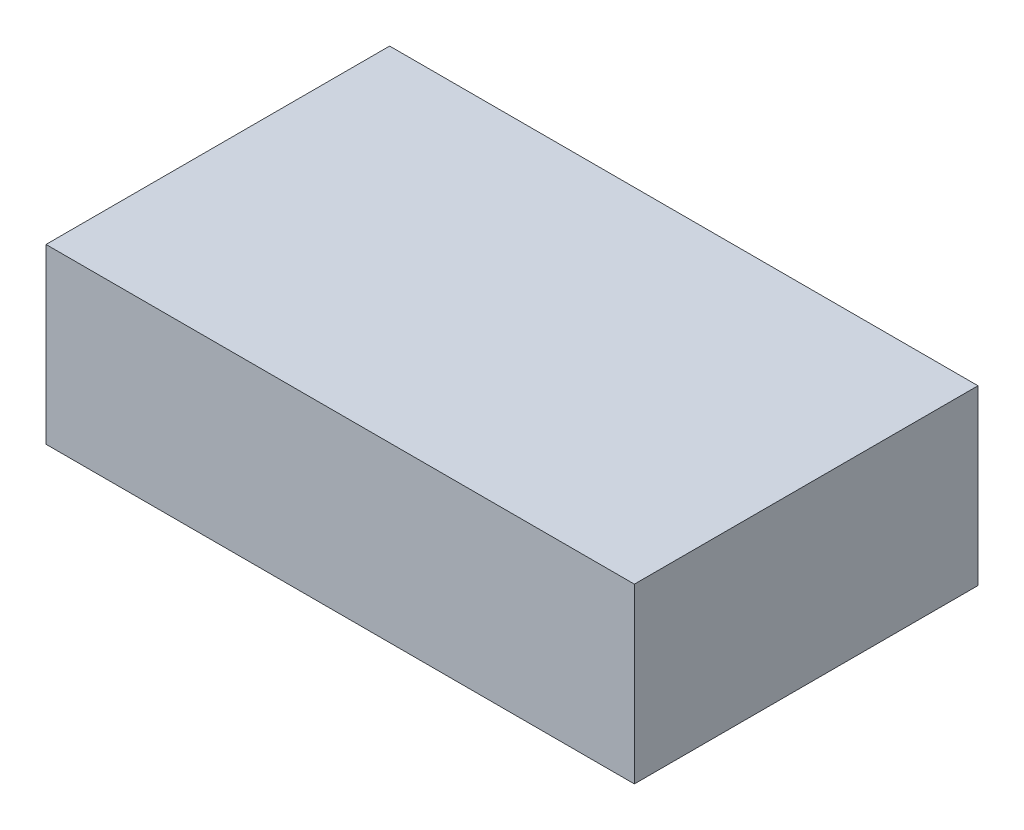
ISO-10303-21;
HEADER;
FILE_DESCRIPTION(('STEP AP214'),'2;1');
FILE_NAME('part.step','',(''),(''),'','','');
FILE_SCHEMA(('AUTOMOTIVE_DESIGN { 1 0 10303 214 1 1 1 1 }'));
ENDSEC;
DATA;
#1=APPLICATION_CONTEXT('core data for automotive mechanical design processes');
#2=APPLICATION_PROTOCOL_DEFINITION('international standard','automotive_design',2000,#1);
#3=PRODUCT_CONTEXT('',#1,'mechanical');
#4=PRODUCT('Part','Part','',(#3));
#5=PRODUCT_RELATED_PRODUCT_CATEGORY('part','',(#4));
#6=PRODUCT_DEFINITION_FORMATION('','',#4);
#7=PRODUCT_DEFINITION_CONTEXT('part definition',#1,'design');
#8=PRODUCT_DEFINITION('design','',#6,#7);
#9=PRODUCT_DEFINITION_SHAPE('','',#8);
#10=(LENGTH_UNIT() NAMED_UNIT(*) SI_UNIT(.MILLI.,.METRE.));
#11=(NAMED_UNIT(*) PLANE_ANGLE_UNIT() SI_UNIT($,.RADIAN.));
#12=(NAMED_UNIT(*) SI_UNIT($,.STERADIAN.) SOLID_ANGLE_UNIT());
#13=UNCERTAINTY_MEASURE_WITH_UNIT(LENGTH_MEASURE(1.E-05),#10,'distance_accuracy_value','');
#14=(GEOMETRIC_REPRESENTATION_CONTEXT(3) GLOBAL_UNCERTAINTY_ASSIGNED_CONTEXT((#13)) GLOBAL_UNIT_ASSIGNED_CONTEXT((#10,
#11,#12)) REPRESENTATION_CONTEXT('',''));
#15=CARTESIAN_POINT('',(0.,0.,0.));
#16=DIRECTION('',(0.,0.,1.));
#17=DIRECTION('',(1.,0.,0.));
#18=AXIS2_PLACEMENT_3D('',#15,#16,#17);
#19=CARTESIAN_POINT('',(0.,70.,0.));
#20=DIRECTION('',(1.,0.,0.));
#21=DIRECTION('',(0.,0.,-1.));
#22=AXIS2_PLACEMENT_3D('',#19,#20,#21);
#23=PLANE('',#22);
#24=DIRECTION('',(0.,0.,1.));
#25=VECTOR('',#24,1.);
#26=CARTESIAN_POINT('',(0.,0.,0.));
#27=LINE('',#26,#25);
#28=CARTESIAN_POINT('',(0.,0.,-139.));
#29=VERTEX_POINT('',#28);
#30=CARTESIAN_POINT('',(0.,0.,0.));
#31=VERTEX_POINT('',#30);
#32=EDGE_CURVE('E100',#29,#31,#27,.T.);
#33=ORIENTED_EDGE('',*,*,#32,.T.);
#34=DIRECTION('',(0.,-1.,0.));
#35=VECTOR('',#34,1.);
#36=CARTESIAN_POINT('',(0.,70.,0.));
#37=LINE('',#36,#35);
#38=CARTESIAN_POINT('',(0.,70.,0.));
#39=VERTEX_POINT('',#38);
#40=EDGE_CURVE('E11',#39,#31,#37,.T.);
#41=ORIENTED_EDGE('',*,*,#40,.F.);
#42=DIRECTION('',(0.,0.,1.));
#43=VECTOR('',#42,1.);
#44=CARTESIAN_POINT('',(0.,70.,0.));
#45=LINE('',#44,#43);
#46=CARTESIAN_POINT('',(0.,70.,-139.));
#47=VERTEX_POINT('',#46);
#48=EDGE_CURVE('E88',#47,#39,#45,.T.);
#49=ORIENTED_EDGE('',*,*,#48,.F.);
#50=DIRECTION('',(0.,-1.,0.));
#51=VECTOR('',#50,1.);
#52=CARTESIAN_POINT('',(0.,70.,-139.));
#53=LINE('',#52,#51);
#54=EDGE_CURVE('E96',#47,#29,#53,.T.);
#55=ORIENTED_EDGE('',*,*,#54,.T.);
#56=EDGE_LOOP('',(#33,#41,#49,#55));
#57=FACE_BOUND('',#56,.T.);
#58=ADVANCED_FACE('F37',(#57),#23,.F.);
#59=CARTESIAN_POINT('',(0.,70.,0.));
#60=DIRECTION('',(0.,0.,-1.));
#61=DIRECTION('',(-1.,0.,0.));
#62=AXIS2_PLACEMENT_3D('',#59,#60,#61);
#63=PLANE('',#62);
#64=DIRECTION('',(1.,0.,0.));
#65=VECTOR('',#64,1.);
#66=CARTESIAN_POINT('',(0.,0.,0.));
#67=LINE('',#66,#65);
#68=CARTESIAN_POINT('',(238.,0.,0.));
#69=VERTEX_POINT('',#68);
#70=EDGE_CURVE('E92',#31,#69,#67,.T.);
#71=ORIENTED_EDGE('',*,*,#70,.T.);
#72=DIRECTION('',(0.,-1.,0.));
#73=VECTOR('',#72,1.);
#74=CARTESIAN_POINT('',(238.,70.,0.));
#75=LINE('',#74,#73);
#76=CARTESIAN_POINT('',(238.,70.,0.));
#77=VERTEX_POINT('',#76);
#78=EDGE_CURVE('E45',#77,#69,#75,.T.);
#79=ORIENTED_EDGE('',*,*,#78,.F.);
#80=DIRECTION('',(1.,0.,0.));
#81=VECTOR('',#80,1.);
#82=CARTESIAN_POINT('',(0.,70.,0.));
#83=LINE('',#82,#81);
#84=EDGE_CURVE('E83',#39,#77,#83,.T.);
#85=ORIENTED_EDGE('',*,*,#84,.F.);
#86=ORIENTED_EDGE('',*,*,#40,.T.);
#87=EDGE_LOOP('',(#71,#79,#85,#86));
#88=FACE_BOUND('',#87,.T.);
#89=ADVANCED_FACE('F91',(#88),#63,.F.);
#90=CARTESIAN_POINT('',(238.,70.,0.));
#91=DIRECTION('',(-1.,0.,0.));
#92=DIRECTION('',(0.,0.,1.));
#93=AXIS2_PLACEMENT_3D('',#90,#91,#92);
#94=PLANE('',#93);
#95=DIRECTION('',(0.,0.,-1.));
#96=VECTOR('',#95,1.);
#97=CARTESIAN_POINT('',(238.,0.,0.));
#98=LINE('',#97,#96);
#99=CARTESIAN_POINT('',(238.,0.,-139.));
#100=VERTEX_POINT('',#99);
#101=EDGE_CURVE('E70',#69,#100,#98,.T.);
#102=ORIENTED_EDGE('',*,*,#101,.T.);
#103=DIRECTION('',(0.,-1.,0.));
#104=VECTOR('',#103,1.);
#105=CARTESIAN_POINT('',(238.,70.,-139.));
#106=LINE('',#105,#104);
#107=CARTESIAN_POINT('',(238.,70.,-139.));
#108=VERTEX_POINT('',#107);
#109=EDGE_CURVE('E93',#108,#100,#106,.T.);
#110=ORIENTED_EDGE('',*,*,#109,.F.);
#111=DIRECTION('',(0.,0.,-1.));
#112=VECTOR('',#111,1.);
#113=CARTESIAN_POINT('',(238.,70.,0.));
#114=LINE('',#113,#112);
#115=EDGE_CURVE('E86',#77,#108,#114,.T.);
#116=ORIENTED_EDGE('',*,*,#115,.F.);
#117=ORIENTED_EDGE('',*,*,#78,.T.);
#118=EDGE_LOOP('',(#102,#110,#116,#117));
#119=FACE_BOUND('',#118,.T.);
#120=ADVANCED_FACE('F94',(#119),#94,.F.);
#121=CARTESIAN_POINT('',(0.,70.,-139.));
#122=DIRECTION('',(0.,0.,1.));
#123=DIRECTION('',(1.,0.,0.));
#124=AXIS2_PLACEMENT_3D('',#121,#122,#123);
#125=PLANE('',#124);
#126=DIRECTION('',(-1.,0.,0.));
#127=VECTOR('',#126,1.);
#128=CARTESIAN_POINT('',(0.,0.,-139.));
#129=LINE('',#128,#127);
#130=EDGE_CURVE('E76',#100,#29,#129,.T.);
#131=ORIENTED_EDGE('',*,*,#130,.T.);
#132=ORIENTED_EDGE('',*,*,#54,.F.);
#133=DIRECTION('',(-1.,0.,0.));
#134=VECTOR('',#133,1.);
#135=CARTESIAN_POINT('',(0.,70.,-139.));
#136=LINE('',#135,#134);
#137=EDGE_CURVE('E53',#108,#47,#136,.T.);
#138=ORIENTED_EDGE('',*,*,#137,.F.);
#139=ORIENTED_EDGE('',*,*,#109,.T.);
#140=EDGE_LOOP('',(#131,#132,#138,#139));
#141=FACE_BOUND('',#140,.T.);
#142=ADVANCED_FACE('F107',(#141),#125,.F.);
#143=CARTESIAN_POINT('',(0.,70.,0.));
#144=DIRECTION('',(0.,-1.,0.));
#145=DIRECTION('',(0.,0.,-1.));
#146=AXIS2_PLACEMENT_3D('',#143,#144,#145);
#147=PLANE('',#146);
#148=ORIENTED_EDGE('',*,*,#48,.T.);
#149=ORIENTED_EDGE('',*,*,#84,.T.);
#150=ORIENTED_EDGE('',*,*,#115,.T.);
#151=ORIENTED_EDGE('',*,*,#137,.T.);
#152=EDGE_LOOP('',(#148,#149,#150,#151));
#153=FACE_BOUND('',#152,.T.);
#154=ADVANCED_FACE('F84',(#153),#147,.F.);
#155=CARTESIAN_POINT('',(0.,0.,0.));
#156=DIRECTION('',(0.,-1.,0.));
#157=DIRECTION('',(0.,0.,-1.));
#158=AXIS2_PLACEMENT_3D('',#155,#156,#157);
#159=PLANE('',#158);
#160=ORIENTED_EDGE('',*,*,#32,.F.);
#161=ORIENTED_EDGE('',*,*,#130,.F.);
#162=ORIENTED_EDGE('',*,*,#101,.F.);
#163=ORIENTED_EDGE('',*,*,#70,.F.);
#164=EDGE_LOOP('',(#160,#161,#162,#163));
#165=FACE_BOUND('',#164,.T.);
#166=ADVANCED_FACE('F110',(#165),#159,.T.);
#167=CLOSED_SHELL('',(#58,#89,#120,#142,#154,#166));
#168=MANIFOLD_SOLID_BREP('B2',#167);
#169=ADVANCED_BREP_SHAPE_REPRESENTATION('',(#18,#168),#14);
#170=SHAPE_DEFINITION_REPRESENTATION(#9,#169);
ENDSEC;
END-ISO-10303-21;
